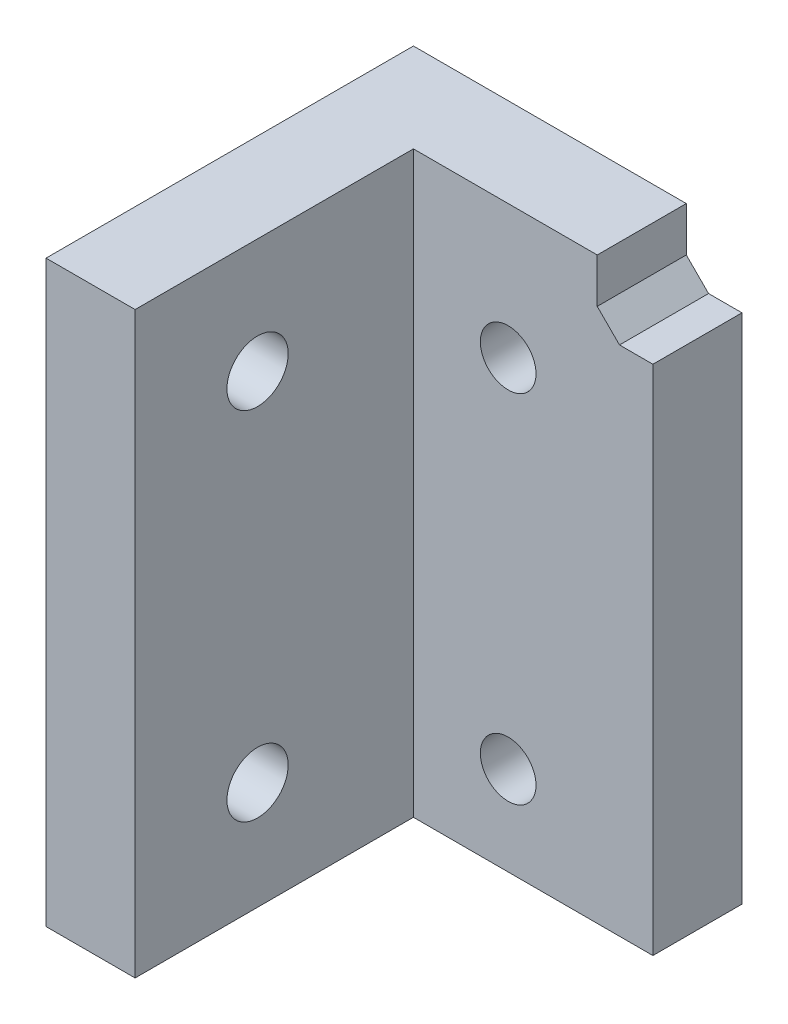
ISO-10303-21;
HEADER;
FILE_DESCRIPTION(('STEP AP214'),'2;1');
FILE_NAME('part.step','',(''),(''),'','','');
FILE_SCHEMA(('AUTOMOTIVE_DESIGN { 1 0 10303 214 1 1 1 1 }'));
ENDSEC;
DATA;
#1=APPLICATION_CONTEXT('core data for automotive mechanical design processes');
#2=APPLICATION_PROTOCOL_DEFINITION('international standard','automotive_design',2000,#1);
#3=PRODUCT_CONTEXT('',#1,'mechanical');
#4=PRODUCT('Part','Part','',(#3));
#5=PRODUCT_RELATED_PRODUCT_CATEGORY('part','',(#4));
#6=PRODUCT_DEFINITION_FORMATION('','',#4);
#7=PRODUCT_DEFINITION_CONTEXT('part definition',#1,'design');
#8=PRODUCT_DEFINITION('design','',#6,#7);
#9=PRODUCT_DEFINITION_SHAPE('','',#8);
#10=(LENGTH_UNIT() NAMED_UNIT(*) SI_UNIT(.MILLI.,.METRE.));
#11=(NAMED_UNIT(*) PLANE_ANGLE_UNIT() SI_UNIT($,.RADIAN.));
#12=(NAMED_UNIT(*) SI_UNIT($,.STERADIAN.) SOLID_ANGLE_UNIT());
#13=UNCERTAINTY_MEASURE_WITH_UNIT(LENGTH_MEASURE(1.E-05),#10,'distance_accuracy_value','');
#14=(GEOMETRIC_REPRESENTATION_CONTEXT(3) GLOBAL_UNCERTAINTY_ASSIGNED_CONTEXT((#13)) GLOBAL_UNIT_ASSIGNED_CONTEXT((#10,
#11,#12)) REPRESENTATION_CONTEXT('',''));
#15=CARTESIAN_POINT('',(0.,0.,0.));
#16=DIRECTION('',(0.,0.,1.));
#17=DIRECTION('',(1.,0.,0.));
#18=AXIS2_PLACEMENT_3D('',#15,#16,#17);
#19=CARTESIAN_POINT('',(0.,0.,8.));
#20=DIRECTION('',(0.,0.,1.));
#21=DIRECTION('',(1.,0.,0.));
#22=AXIS2_PLACEMENT_3D('',#19,#20,#21);
#23=PLANE('',#22);
#24=DIRECTION('',(1.,0.,0.));
#25=VECTOR('',#24,1.);
#26=CARTESIAN_POINT('',(0.,52.,8.));
#27=LINE('',#26,#25);
#28=CARTESIAN_POINT('',(-16.51,52.,8.));
#29=VERTEX_POINT('',#28);
#30=CARTESIAN_POINT('',(0.,52.,8.));
#31=VERTEX_POINT('',#30);
#32=EDGE_CURVE('E193',#29,#31,#27,.T.);
#33=ORIENTED_EDGE('',*,*,#32,.F.);
#34=DIRECTION('',(0.,1.,0.));
#35=VECTOR('',#34,1.);
#36=CARTESIAN_POINT('',(-16.51,148.,8.));
#37=LINE('',#36,#35);
#38=CARTESIAN_POINT('',(-16.51,0.,8.));
#39=VERTEX_POINT('',#38);
#40=EDGE_CURVE('E151',#39,#29,#37,.T.);
#41=ORIENTED_EDGE('',*,*,#40,.F.);
#42=DIRECTION('',(1.,0.,0.));
#43=VECTOR('',#42,1.);
#44=CARTESIAN_POINT('',(0.,0.,8.));
#45=LINE('',#44,#43);
#46=CARTESIAN_POINT('',(5.,0.,8.));
#47=VERTEX_POINT('',#46);
#48=EDGE_CURVE('E148',#39,#47,#45,.T.);
#49=ORIENTED_EDGE('',*,*,#48,.T.);
#50=DIRECTION('',(0.,-1.,0.));
#51=VECTOR('',#50,1.);
#52=CARTESIAN_POINT('',(5.,0.,8.));
#53=LINE('',#52,#51);
#54=CARTESIAN_POINT('',(5.,46.,8.));
#55=VERTEX_POINT('',#54);
#56=EDGE_CURVE('E184',#55,#47,#53,.T.);
#57=ORIENTED_EDGE('',*,*,#56,.F.);
#58=DIRECTION('',(1.,0.,0.));
#59=VECTOR('',#58,1.);
#60=CARTESIAN_POINT('',(0.,46.,8.));
#61=LINE('',#60,#59);
#62=CARTESIAN_POINT('',(1.99999999999999,46.,8.));
#63=VERTEX_POINT('',#62);
#64=EDGE_CURVE('E175',#63,#55,#61,.T.);
#65=ORIENTED_EDGE('',*,*,#64,.F.);
#66=DIRECTION('',(-0.707106781186545,0.70710678118655,0.));
#67=VECTOR('',#66,1.);
#68=CARTESIAN_POINT('',(0.,48.,8.));
#69=LINE('',#68,#67);
#70=CARTESIAN_POINT('',(0.,48.,8.));
#71=VERTEX_POINT('',#70);
#72=EDGE_CURVE('E11',#63,#71,#69,.T.);
#73=ORIENTED_EDGE('',*,*,#72,.T.);
#74=DIRECTION('',(0.,1.,0.));
#75=VECTOR('',#74,1.);
#76=CARTESIAN_POINT('',(0.,0.,8.));
#77=LINE('',#76,#75);
#78=EDGE_CURVE('E136',#71,#31,#77,.T.);
#79=ORIENTED_EDGE('',*,*,#78,.T.);
#80=EDGE_LOOP('',(#33,#41,#49,#57,#65,#73,#79));
#81=FACE_BOUND('',#80,.T.);
#82=CARTESIAN_POINT('',(-8.,40.,8.));
#83=DIRECTION('',(0.,0.,1.));
#84=DIRECTION('',(1.,0.,0.));
#85=AXIS2_PLACEMENT_3D('',#82,#83,#84);
#86=CIRCLE('',#85,2.5);
#87=CARTESIAN_POINT('',(-5.5,40.,8.));
#88=VERTEX_POINT('',#87);
#89=EDGE_CURVE('E224',#88,#88,#86,.T.);
#90=ORIENTED_EDGE('',*,*,#89,.F.);
#91=EDGE_LOOP('',(#90));
#92=FACE_BOUND('',#91,.T.);
#93=CARTESIAN_POINT('',(-8.,8.,8.));
#94=DIRECTION('',(0.,0.,1.));
#95=DIRECTION('',(1.,0.,0.));
#96=AXIS2_PLACEMENT_3D('',#93,#94,#95);
#97=CIRCLE('',#96,2.5);
#98=CARTESIAN_POINT('',(-5.5,8.,8.));
#99=VERTEX_POINT('',#98);
#100=EDGE_CURVE('E212',#99,#99,#97,.T.);
#101=ORIENTED_EDGE('',*,*,#100,.F.);
#102=EDGE_LOOP('',(#101));
#103=FACE_BOUND('',#102,.T.);
#104=ADVANCED_FACE('F39',(#81,#92,#103),#23,.T.);
#105=CARTESIAN_POINT('',(0.,0.,8.));
#106=DIRECTION('',(-1.,0.,0.));
#107=DIRECTION('',(0.,0.,1.));
#108=AXIS2_PLACEMENT_3D('',#105,#106,#107);
#109=PLANE('',#108);
#110=DIRECTION('',(0.,1.,0.));
#111=VECTOR('',#110,1.);
#112=CARTESIAN_POINT('',(0.,0.,0.));
#113=LINE('',#112,#111);
#114=CARTESIAN_POINT('',(0.,48.,0.));
#115=VERTEX_POINT('',#114);
#116=CARTESIAN_POINT('',(0.,52.,0.));
#117=VERTEX_POINT('',#116);
#118=EDGE_CURVE('E132',#115,#117,#113,.T.);
#119=ORIENTED_EDGE('',*,*,#118,.T.);
#120=DIRECTION('',(0.,0.,1.));
#121=VECTOR('',#120,1.);
#122=CARTESIAN_POINT('',(0.,52.,8.00000000000001));
#123=LINE('',#122,#121);
#124=EDGE_CURVE('E110',#117,#31,#123,.T.);
#125=ORIENTED_EDGE('',*,*,#124,.T.);
#126=ORIENTED_EDGE('',*,*,#78,.F.);
#127=DIRECTION('',(0.,0.,-1.));
#128=VECTOR('',#127,1.);
#129=CARTESIAN_POINT('',(0.,48.,8.));
#130=LINE('',#129,#128);
#131=EDGE_CURVE('E147',#71,#115,#130,.T.);
#132=ORIENTED_EDGE('',*,*,#131,.T.);
#133=EDGE_LOOP('',(#119,#125,#126,#132));
#134=FACE_BOUND('',#133,.T.);
#135=ADVANCED_FACE('F192',(#134),#109,.F.);
#136=CARTESIAN_POINT('',(-24.51,0.,8.));
#137=DIRECTION('',(1.,0.,0.));
#138=DIRECTION('',(0.,0.,-1.));
#139=AXIS2_PLACEMENT_3D('',#136,#137,#138);
#140=PLANE('',#139);
#141=CARTESIAN_POINT('',(-24.51,9.70000000000035,22.0000000000002));
#142=DIRECTION('',(-1.,0.,0.));
#143=DIRECTION('',(0.,0.,1.));
#144=AXIS2_PLACEMENT_3D('',#141,#142,#143);
#145=CIRCLE('',#144,2.75);
#146=CARTESIAN_POINT('',(-24.51,9.70000000000035,24.7500000000002));
#147=VERTEX_POINT('',#146);
#148=EDGE_CURVE('E254',#147,#147,#145,.T.);
#149=ORIENTED_EDGE('',*,*,#148,.F.);
#150=EDGE_LOOP('',(#149));
#151=FACE_BOUND('',#150,.T.);
#152=CARTESIAN_POINT('',(-24.51,41.7000000000004,22.0000000000002));
#153=DIRECTION('',(-1.,0.,0.));
#154=DIRECTION('',(0.,0.,1.));
#155=AXIS2_PLACEMENT_3D('',#152,#153,#154);
#156=CIRCLE('',#155,2.75);
#157=CARTESIAN_POINT('',(-24.51,41.7000000000004,24.7500000000002));
#158=VERTEX_POINT('',#157);
#159=EDGE_CURVE('E235',#158,#158,#156,.T.);
#160=ORIENTED_EDGE('',*,*,#159,.F.);
#161=EDGE_LOOP('',(#160));
#162=FACE_BOUND('',#161,.T.);
#163=DIRECTION('',(0.,-1.,0.));
#164=VECTOR('',#163,1.);
#165=CARTESIAN_POINT('',(-24.51,148.,33.));
#166=LINE('',#165,#164);
#167=CARTESIAN_POINT('',(-24.51,52.,33.));
#168=VERTEX_POINT('',#167);
#169=CARTESIAN_POINT('',(-24.51,0.,33.));
#170=VERTEX_POINT('',#169);
#171=EDGE_CURVE('E123',#168,#170,#166,.T.);
#172=ORIENTED_EDGE('',*,*,#171,.F.);
#173=DIRECTION('',(0.,0.,-1.));
#174=VECTOR('',#173,1.);
#175=CARTESIAN_POINT('',(-24.51,52.,8.00000000000001));
#176=LINE('',#175,#174);
#177=CARTESIAN_POINT('',(-24.51,52.,0.));
#178=VERTEX_POINT('',#177);
#179=EDGE_CURVE('E55',#168,#178,#176,.T.);
#180=ORIENTED_EDGE('',*,*,#179,.T.);
#181=DIRECTION('',(0.,-1.,0.));
#182=VECTOR('',#181,1.);
#183=CARTESIAN_POINT('',(-24.51,0.,0.));
#184=LINE('',#183,#182);
#185=CARTESIAN_POINT('',(-24.51,0.,0.));
#186=VERTEX_POINT('',#185);
#187=EDGE_CURVE('E121',#178,#186,#184,.T.);
#188=ORIENTED_EDGE('',*,*,#187,.T.);
#189=DIRECTION('',(0.,0.,-1.));
#190=VECTOR('',#189,1.);
#191=CARTESIAN_POINT('',(-24.51,0.,8.));
#192=LINE('',#191,#190);
#193=EDGE_CURVE('E144',#170,#186,#192,.T.);
#194=ORIENTED_EDGE('',*,*,#193,.F.);
#195=EDGE_LOOP('',(#172,#180,#188,#194));
#196=FACE_BOUND('',#195,.T.);
#197=ADVANCED_FACE('F119',(#151,#162,#196),#140,.F.);
#198=CARTESIAN_POINT('',(0.,0.,8.));
#199=DIRECTION('',(0.,1.,0.));
#200=DIRECTION('',(-1.,0.,0.));
#201=AXIS2_PLACEMENT_3D('',#198,#199,#200);
#202=PLANE('',#201);
#203=DIRECTION('',(1.,0.,0.));
#204=VECTOR('',#203,1.);
#205=CARTESIAN_POINT('',(0.,0.,0.));
#206=LINE('',#205,#204);
#207=CARTESIAN_POINT('',(5.,0.,0.));
#208=VERTEX_POINT('',#207);
#209=EDGE_CURVE('E130',#186,#208,#206,.T.);
#210=ORIENTED_EDGE('',*,*,#209,.T.);
#211=DIRECTION('',(0.,0.,-1.));
#212=VECTOR('',#211,1.);
#213=CARTESIAN_POINT('',(5.,0.,54.2709412050371));
#214=LINE('',#213,#212);
#215=EDGE_CURVE('E250',#47,#208,#214,.T.);
#216=ORIENTED_EDGE('',*,*,#215,.F.);
#217=ORIENTED_EDGE('',*,*,#48,.F.);
#218=DIRECTION('',(0.,0.,-1.));
#219=VECTOR('',#218,1.);
#220=CARTESIAN_POINT('',(-16.51,0.,33.));
#221=LINE('',#220,#219);
#222=CARTESIAN_POINT('',(-16.51,0.,33.));
#223=VERTEX_POINT('',#222);
#224=EDGE_CURVE('E138',#223,#39,#221,.T.);
#225=ORIENTED_EDGE('',*,*,#224,.F.);
#226=DIRECTION('',(1.,0.,0.));
#227=VECTOR('',#226,1.);
#228=CARTESIAN_POINT('',(-24.51,0.,33.));
#229=LINE('',#228,#227);
#230=EDGE_CURVE('E209',#170,#223,#229,.T.);
#231=ORIENTED_EDGE('',*,*,#230,.F.);
#232=ORIENTED_EDGE('',*,*,#193,.T.);
#233=EDGE_LOOP('',(#210,#216,#217,#225,#231,#232));
#234=FACE_BOUND('',#233,.T.);
#235=ADVANCED_FACE('F247',(#234),#202,.F.);
#236=CARTESIAN_POINT('',(0.,0.,0.));
#237=DIRECTION('',(0.,0.,1.));
#238=DIRECTION('',(1.,0.,0.));
#239=AXIS2_PLACEMENT_3D('',#236,#237,#238);
#240=PLANE('',#239);
#241=CARTESIAN_POINT('',(-8.,40.,0.));
#242=DIRECTION('',(0.,0.,1.));
#243=DIRECTION('',(1.,0.,0.));
#244=AXIS2_PLACEMENT_3D('',#241,#242,#243);
#245=CIRCLE('',#244,2.5);
#246=CARTESIAN_POINT('',(-5.5,40.,0.));
#247=VERTEX_POINT('',#246);
#248=EDGE_CURVE('E218',#247,#247,#245,.T.);
#249=ORIENTED_EDGE('',*,*,#248,.T.);
#250=EDGE_LOOP('',(#249));
#251=FACE_BOUND('',#250,.T.);
#252=CARTESIAN_POINT('',(-8.,8.,0.));
#253=DIRECTION('',(0.,0.,1.));
#254=DIRECTION('',(1.,0.,0.));
#255=AXIS2_PLACEMENT_3D('',#252,#253,#254);
#256=CIRCLE('',#255,2.5);
#257=CARTESIAN_POINT('',(-5.5,8.,0.));
#258=VERTEX_POINT('',#257);
#259=EDGE_CURVE('E206',#258,#258,#256,.T.);
#260=ORIENTED_EDGE('',*,*,#259,.T.);
#261=EDGE_LOOP('',(#260));
#262=FACE_BOUND('',#261,.T.);
#263=ORIENTED_EDGE('',*,*,#187,.F.);
#264=DIRECTION('',(1.,0.,0.));
#265=VECTOR('',#264,1.);
#266=CARTESIAN_POINT('',(-24.7,52.,0.));
#267=LINE('',#266,#265);
#268=EDGE_CURVE('E107',#178,#117,#267,.T.);
#269=ORIENTED_EDGE('',*,*,#268,.T.);
#270=ORIENTED_EDGE('',*,*,#118,.F.);
#271=DIRECTION('',(0.707106781186545,-0.70710678118655,0.));
#272=VECTOR('',#271,1.);
#273=CARTESIAN_POINT('',(24.,23.9999999999998,0.));
#274=LINE('',#273,#272);
#275=CARTESIAN_POINT('',(1.99999999999999,46.,0.));
#276=VERTEX_POINT('',#275);
#277=EDGE_CURVE('E48',#115,#276,#274,.T.);
#278=ORIENTED_EDGE('',*,*,#277,.T.);
#279=DIRECTION('',(1.,0.,0.));
#280=VECTOR('',#279,1.);
#281=CARTESIAN_POINT('',(0.,46.,0.));
#282=LINE('',#281,#280);
#283=CARTESIAN_POINT('',(5.,46.,0.));
#284=VERTEX_POINT('',#283);
#285=EDGE_CURVE('E125',#276,#284,#282,.T.);
#286=ORIENTED_EDGE('',*,*,#285,.T.);
#287=DIRECTION('',(0.,-1.,0.));
#288=VECTOR('',#287,1.);
#289=CARTESIAN_POINT('',(5.,0.,0.));
#290=LINE('',#289,#288);
#291=EDGE_CURVE('E188',#284,#208,#290,.T.);
#292=ORIENTED_EDGE('',*,*,#291,.T.);
#293=ORIENTED_EDGE('',*,*,#209,.F.);
#294=EDGE_LOOP('',(#263,#269,#270,#278,#286,#292,#293));
#295=FACE_BOUND('',#294,.T.);
#296=ADVANCED_FACE('F128',(#251,#262,#295),#240,.F.);
#297=CARTESIAN_POINT('',(-16.51,148.,33.));
#298=DIRECTION('',(-1.,0.,0.));
#299=DIRECTION('',(0.,-1.,0.));
#300=AXIS2_PLACEMENT_3D('',#297,#298,#299);
#301=PLANE('',#300);
#302=CARTESIAN_POINT('',(-16.51,9.70000000000035,22.0000000000002));
#303=DIRECTION('',(-1.,0.,0.));
#304=DIRECTION('',(0.,-1.,0.));
#305=AXIS2_PLACEMENT_3D('',#302,#303,#304);
#306=CIRCLE('',#305,2.75);
#307=CARTESIAN_POINT('',(-16.51,6.95000000000035,22.0000000000002));
#308=VERTEX_POINT('',#307);
#309=EDGE_CURVE('E266',#308,#308,#306,.F.);
#310=ORIENTED_EDGE('',*,*,#309,.F.);
#311=EDGE_LOOP('',(#310));
#312=FACE_BOUND('',#311,.T.);
#313=CARTESIAN_POINT('',(-16.51,41.7000000000004,22.0000000000002));
#314=DIRECTION('',(-1.,0.,0.));
#315=DIRECTION('',(0.,-1.,0.));
#316=AXIS2_PLACEMENT_3D('',#313,#314,#315);
#317=CIRCLE('',#316,2.75);
#318=CARTESIAN_POINT('',(-16.51,38.9500000000003,22.0000000000002));
#319=VERTEX_POINT('',#318);
#320=EDGE_CURVE('E229',#319,#319,#317,.F.);
#321=ORIENTED_EDGE('',*,*,#320,.F.);
#322=EDGE_LOOP('',(#321));
#323=FACE_BOUND('',#322,.T.);
#324=ORIENTED_EDGE('',*,*,#40,.T.);
#325=DIRECTION('',(0.,0.,1.));
#326=VECTOR('',#325,1.);
#327=CARTESIAN_POINT('',(-16.51,52.,33.));
#328=LINE('',#327,#326);
#329=CARTESIAN_POINT('',(-16.51,52.,33.));
#330=VERTEX_POINT('',#329);
#331=EDGE_CURVE('E114',#29,#330,#328,.T.);
#332=ORIENTED_EDGE('',*,*,#331,.T.);
#333=DIRECTION('',(0.,1.,0.));
#334=VECTOR('',#333,1.);
#335=CARTESIAN_POINT('',(-16.51,148.,33.));
#336=LINE('',#335,#334);
#337=EDGE_CURVE('E240',#223,#330,#336,.T.);
#338=ORIENTED_EDGE('',*,*,#337,.F.);
#339=ORIENTED_EDGE('',*,*,#224,.T.);
#340=EDGE_LOOP('',(#324,#332,#338,#339));
#341=FACE_BOUND('',#340,.T.);
#342=ADVANCED_FACE('F201',(#312,#323,#341),#301,.F.);
#343=CARTESIAN_POINT('',(0.,0.,33.));
#344=DIRECTION('',(0.,0.,1.));
#345=DIRECTION('',(1.,0.,0.));
#346=AXIS2_PLACEMENT_3D('',#343,#344,#345);
#347=PLANE('',#346);
#348=DIRECTION('',(1.,0.,0.));
#349=VECTOR('',#348,1.);
#350=CARTESIAN_POINT('',(-24.7,52.,33.));
#351=LINE('',#350,#349);
#352=EDGE_CURVE('E115',#168,#330,#351,.T.);
#353=ORIENTED_EDGE('',*,*,#352,.F.);
#354=ORIENTED_EDGE('',*,*,#171,.T.);
#355=ORIENTED_EDGE('',*,*,#230,.T.);
#356=ORIENTED_EDGE('',*,*,#337,.T.);
#357=EDGE_LOOP('',(#353,#354,#355,#356));
#358=FACE_BOUND('',#357,.T.);
#359=ADVANCED_FACE('F244',(#358),#347,.T.);
#360=CARTESIAN_POINT('',(-8.,8.,-2.));
#361=DIRECTION('',(0.,0.,1.));
#362=DIRECTION('',(1.,0.,0.));
#363=AXIS2_PLACEMENT_3D('',#360,#361,#362);
#364=CYLINDRICAL_SURFACE('',#363,2.5);
#365=ORIENTED_EDGE('',*,*,#100,.T.);
#366=EDGE_LOOP('',(#365));
#367=FACE_BOUND('',#366,.T.);
#368=ORIENTED_EDGE('',*,*,#259,.F.);
#369=EDGE_LOOP('',(#368));
#370=FACE_BOUND('',#369,.T.);
#371=ADVANCED_FACE('F300',(#367,#370),#364,.F.);
#372=CARTESIAN_POINT('',(-8.,40.,-2.));
#373=DIRECTION('',(0.,0.,1.));
#374=DIRECTION('',(1.,0.,0.));
#375=AXIS2_PLACEMENT_3D('',#372,#373,#374);
#376=CYLINDRICAL_SURFACE('',#375,2.5);
#377=ORIENTED_EDGE('',*,*,#89,.T.);
#378=EDGE_LOOP('',(#377));
#379=FACE_BOUND('',#378,.T.);
#380=ORIENTED_EDGE('',*,*,#248,.F.);
#381=EDGE_LOOP('',(#380));
#382=FACE_BOUND('',#381,.T.);
#383=ADVANCED_FACE('F307',(#379,#382),#376,.F.);
#384=CARTESIAN_POINT('',(-8.73182540694797,41.7000000000004,22.0000000000002));
#385=DIRECTION('',(-1.,0.,0.));
#386=DIRECTION('',(0.,0.,1.));
#387=AXIS2_PLACEMENT_3D('',#384,#385,#386);
#388=CYLINDRICAL_SURFACE('',#387,2.75);
#389=ORIENTED_EDGE('',*,*,#320,.T.);
#390=EDGE_LOOP('',(#389));
#391=FACE_BOUND('',#390,.T.);
#392=ORIENTED_EDGE('',*,*,#159,.T.);
#393=EDGE_LOOP('',(#392));
#394=FACE_BOUND('',#393,.T.);
#395=ADVANCED_FACE('F273',(#391,#394),#388,.F.);
#396=CARTESIAN_POINT('',(-8.73182540694797,9.70000000000035,22.0000000000002));
#397=DIRECTION('',(-1.,0.,0.));
#398=DIRECTION('',(0.,0.,1.));
#399=AXIS2_PLACEMENT_3D('',#396,#397,#398);
#400=CYLINDRICAL_SURFACE('',#399,2.75);
#401=ORIENTED_EDGE('',*,*,#309,.T.);
#402=EDGE_LOOP('',(#401));
#403=FACE_BOUND('',#402,.T.);
#404=ORIENTED_EDGE('',*,*,#148,.T.);
#405=EDGE_LOOP('',(#404));
#406=FACE_BOUND('',#405,.T.);
#407=ADVANCED_FACE('F306',(#403,#406),#400,.F.);
#408=CARTESIAN_POINT('',(0.,46.,54.2709412050371));
#409=DIRECTION('',(0.,1.,0.));
#410=DIRECTION('',(0.,0.,1.));
#411=AXIS2_PLACEMENT_3D('',#408,#409,#410);
#412=PLANE('',#411);
#413=ORIENTED_EDGE('',*,*,#285,.F.);
#414=DIRECTION('',(0.,0.,1.));
#415=VECTOR('',#414,1.);
#416=CARTESIAN_POINT('',(1.99999999999999,46.,54.2709412050371));
#417=LINE('',#416,#415);
#418=EDGE_CURVE('E167',#276,#63,#417,.T.);
#419=ORIENTED_EDGE('',*,*,#418,.T.);
#420=ORIENTED_EDGE('',*,*,#64,.T.);
#421=DIRECTION('',(0.,0.,-1.));
#422=VECTOR('',#421,1.);
#423=CARTESIAN_POINT('',(5.,46.,54.2709412050371));
#424=LINE('',#423,#422);
#425=EDGE_CURVE('E187',#55,#284,#424,.T.);
#426=ORIENTED_EDGE('',*,*,#425,.T.);
#427=EDGE_LOOP('',(#413,#419,#420,#426));
#428=FACE_BOUND('',#427,.T.);
#429=ADVANCED_FACE('F173',(#428),#412,.T.);
#430=CARTESIAN_POINT('',(5.,0.,54.2709412050371));
#431=DIRECTION('',(1.,0.,0.));
#432=DIRECTION('',(0.,0.,-1.));
#433=AXIS2_PLACEMENT_3D('',#430,#431,#432);
#434=PLANE('',#433);
#435=ORIENTED_EDGE('',*,*,#425,.F.);
#436=ORIENTED_EDGE('',*,*,#56,.T.);
#437=ORIENTED_EDGE('',*,*,#215,.T.);
#438=ORIENTED_EDGE('',*,*,#291,.F.);
#439=EDGE_LOOP('',(#435,#436,#437,#438));
#440=FACE_BOUND('',#439,.T.);
#441=ADVANCED_FACE('F256',(#440),#434,.T.);
#442=CARTESIAN_POINT('',(0.,48.,8.));
#443=DIRECTION('',(-0.70710678118655,-0.707106781186545,0.));
#444=DIRECTION('',(0.,0.,-1.));
#445=AXIS2_PLACEMENT_3D('',#442,#443,#444);
#446=PLANE('',#445);
#447=ORIENTED_EDGE('',*,*,#72,.F.);
#448=ORIENTED_EDGE('',*,*,#418,.F.);
#449=ORIENTED_EDGE('',*,*,#277,.F.);
#450=ORIENTED_EDGE('',*,*,#131,.F.);
#451=EDGE_LOOP('',(#447,#448,#449,#450));
#452=FACE_BOUND('',#451,.T.);
#453=ADVANCED_FACE('F41',(#452),#446,.F.);
#454=CARTESIAN_POINT('',(-24.7,52.,0.));
#455=DIRECTION('',(0.,-1.,0.));
#456=DIRECTION('',(0.,0.,-1.));
#457=AXIS2_PLACEMENT_3D('',#454,#455,#456);
#458=PLANE('',#457);
#459=ORIENTED_EDGE('',*,*,#352,.T.);
#460=ORIENTED_EDGE('',*,*,#331,.F.);
#461=ORIENTED_EDGE('',*,*,#32,.T.);
#462=ORIENTED_EDGE('',*,*,#124,.F.);
#463=ORIENTED_EDGE('',*,*,#268,.F.);
#464=ORIENTED_EDGE('',*,*,#179,.F.);
#465=EDGE_LOOP('',(#459,#460,#461,#462,#463,#464));
#466=FACE_BOUND('',#465,.T.);
#467=ADVANCED_FACE('F108',(#466),#458,.F.);
#468=CLOSED_SHELL('',(#104,#135,#197,#235,#296,#342,#359,#371,#383,#395,#407,#429,#441,#453,#467));
#469=MANIFOLD_SOLID_BREP('B2',#468);
#470=ADVANCED_BREP_SHAPE_REPRESENTATION('',(#18,#469),#14);
#471=SHAPE_DEFINITION_REPRESENTATION(#9,#470);
ENDSEC;
END-ISO-10303-21;
